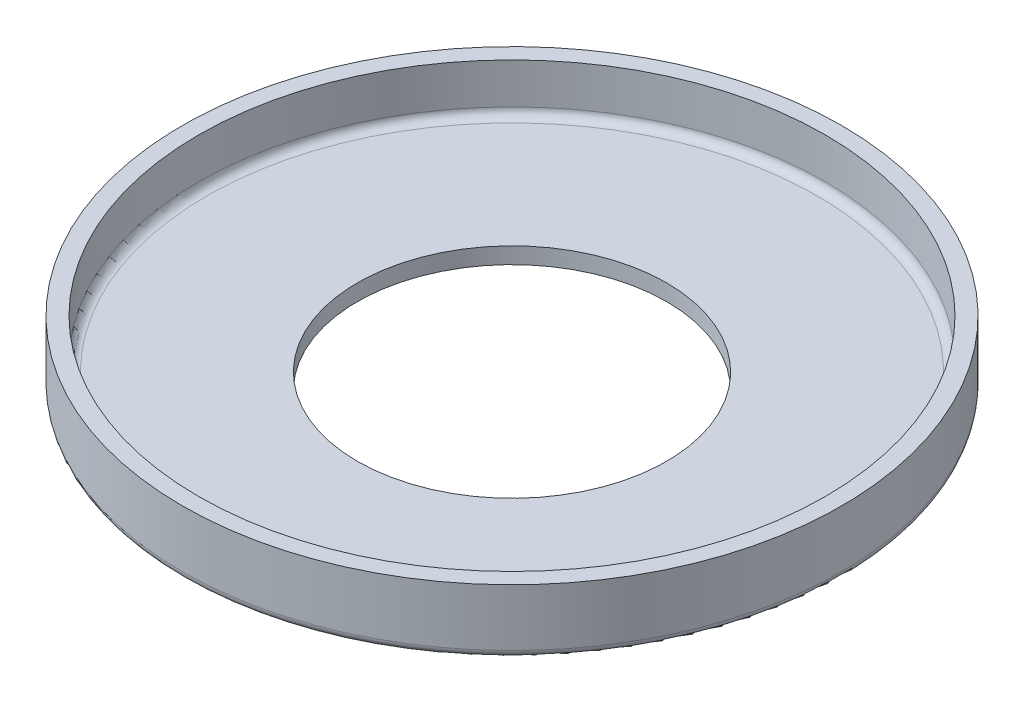
ISO-10303-21;
HEADER;
FILE_DESCRIPTION(('STEP AP214'),'2;1');
FILE_NAME('part.step','',(''),(''),'','','');
FILE_SCHEMA(('AUTOMOTIVE_DESIGN { 1 0 10303 214 1 1 1 1 }'));
ENDSEC;
DATA;
#1=APPLICATION_CONTEXT('core data for automotive mechanical design processes');
#2=APPLICATION_PROTOCOL_DEFINITION('international standard','automotive_design',2000,#1);
#3=PRODUCT_CONTEXT('',#1,'mechanical');
#4=PRODUCT('Part','Part','',(#3));
#5=PRODUCT_RELATED_PRODUCT_CATEGORY('part','',(#4));
#6=PRODUCT_DEFINITION_FORMATION('','',#4);
#7=PRODUCT_DEFINITION_CONTEXT('part definition',#1,'design');
#8=PRODUCT_DEFINITION('design','',#6,#7);
#9=PRODUCT_DEFINITION_SHAPE('','',#8);
#10=(LENGTH_UNIT() NAMED_UNIT(*) SI_UNIT(.MILLI.,.METRE.));
#11=(NAMED_UNIT(*) PLANE_ANGLE_UNIT() SI_UNIT($,.RADIAN.));
#12=(NAMED_UNIT(*) SI_UNIT($,.STERADIAN.) SOLID_ANGLE_UNIT());
#13=UNCERTAINTY_MEASURE_WITH_UNIT(LENGTH_MEASURE(1.E-05),#10,'distance_accuracy_value','');
#14=(GEOMETRIC_REPRESENTATION_CONTEXT(3) GLOBAL_UNCERTAINTY_ASSIGNED_CONTEXT((#13)) GLOBAL_UNIT_ASSIGNED_CONTEXT((#10,
#11,#12)) REPRESENTATION_CONTEXT('',''));
#15=CARTESIAN_POINT('',(0.,0.,0.));
#16=DIRECTION('',(0.,0.,1.));
#17=DIRECTION('',(1.,0.,0.));
#18=AXIS2_PLACEMENT_3D('',#15,#16,#17);
#19=CARTESIAN_POINT('',(0.,2.,0.));
#20=DIRECTION('',(0.,-1.,0.));
#21=DIRECTION('',(0.,0.,-1.));
#22=AXIS2_PLACEMENT_3D('',#19,#20,#21);
#23=CYLINDRICAL_SURFACE('',#22,19.);
#24=CARTESIAN_POINT('',(0.,2.,0.));
#25=DIRECTION('',(0.,1.,0.));
#26=DIRECTION('',(0.,0.,1.));
#27=AXIS2_PLACEMENT_3D('',#24,#25,#26);
#28=CIRCLE('',#27,19.);
#29=CARTESIAN_POINT('',(0.,2.,19.));
#30=VERTEX_POINT('',#29);
#31=EDGE_CURVE('E63',#30,#30,#28,.T.);
#32=ORIENTED_EDGE('',*,*,#31,.T.);
#33=EDGE_LOOP('',(#32));
#34=FACE_BOUND('',#33,.T.);
#35=CARTESIAN_POINT('',(0.,0.,0.));
#36=DIRECTION('',(0.,1.,0.));
#37=DIRECTION('',(0.,0.,1.));
#38=AXIS2_PLACEMENT_3D('',#35,#36,#37);
#39=CIRCLE('',#38,19.);
#40=CARTESIAN_POINT('',(0.,0.,19.));
#41=VERTEX_POINT('',#40);
#42=EDGE_CURVE('E64',#41,#41,#39,.T.);
#43=ORIENTED_EDGE('',*,*,#42,.F.);
#44=EDGE_LOOP('',(#43));
#45=FACE_BOUND('',#44,.T.);
#46=ADVANCED_FACE('F39',(#34,#45),#23,.F.);
#47=CARTESIAN_POINT('',(0.,2.,0.));
#48=DIRECTION('',(0.,-1.,0.));
#49=DIRECTION('',(0.,0.,-1.));
#50=AXIS2_PLACEMENT_3D('',#47,#48,#49);
#51=CYLINDRICAL_SURFACE('',#50,40.5);
#52=CARTESIAN_POINT('',(0.,1.,0.));
#53=DIRECTION('',(0.,1.,0.));
#54=DIRECTION('',(0.,0.,1.));
#55=AXIS2_PLACEMENT_3D('',#52,#53,#54);
#56=CIRCLE('',#55,40.5);
#57=CARTESIAN_POINT('',(0.,1.,40.5));
#58=VERTEX_POINT('',#57);
#59=EDGE_CURVE('E57',#58,#58,#56,.T.);
#60=ORIENTED_EDGE('',*,*,#59,.T.);
#61=EDGE_LOOP('',(#60));
#62=FACE_BOUND('',#61,.T.);
#63=CARTESIAN_POINT('',(0.,8.,0.));
#64=DIRECTION('',(0.,1.,0.));
#65=DIRECTION('',(0.,0.,1.));
#66=AXIS2_PLACEMENT_3D('',#63,#64,#65);
#67=CIRCLE('',#66,40.5);
#68=CARTESIAN_POINT('',(0.,8.,40.5));
#69=VERTEX_POINT('',#68);
#70=EDGE_CURVE('E68',#69,#69,#67,.T.);
#71=ORIENTED_EDGE('',*,*,#70,.F.);
#72=EDGE_LOOP('',(#71));
#73=FACE_BOUND('',#72,.T.);
#74=ADVANCED_FACE('F89',(#62,#73),#51,.T.);
#75=CARTESIAN_POINT('',(0.,2.,0.));
#76=DIRECTION('',(0.,1.,0.));
#77=DIRECTION('',(0.,0.,1.));
#78=AXIS2_PLACEMENT_3D('',#75,#76,#77);
#79=PLANE('',#78);
#80=CARTESIAN_POINT('',(0.,2.,0.));
#81=DIRECTION('',(0.,1.,0.));
#82=DIRECTION('',(0.,0.,1.));
#83=AXIS2_PLACEMENT_3D('',#80,#81,#82);
#84=CIRCLE('',#83,37.5);
#85=CARTESIAN_POINT('',(0.,2.,37.5));
#86=VERTEX_POINT('',#85);
#87=EDGE_CURVE('E10',#86,#86,#84,.T.);
#88=ORIENTED_EDGE('',*,*,#87,.T.);
#89=EDGE_LOOP('',(#88));
#90=FACE_BOUND('',#89,.T.);
#91=ORIENTED_EDGE('',*,*,#31,.F.);
#92=EDGE_LOOP('',(#91));
#93=FACE_BOUND('',#92,.T.);
#94=ADVANCED_FACE('F91',(#90,#93),#79,.T.);
#95=CARTESIAN_POINT('',(0.,0.,0.));
#96=DIRECTION('',(0.,1.,0.));
#97=DIRECTION('',(0.,0.,1.));
#98=AXIS2_PLACEMENT_3D('',#95,#96,#97);
#99=PLANE('',#98);
#100=CARTESIAN_POINT('',(0.,0.,0.));
#101=DIRECTION('',(0.,1.,0.));
#102=DIRECTION('',(0.,0.,1.));
#103=AXIS2_PLACEMENT_3D('',#100,#101,#102);
#104=CIRCLE('',#103,39.5);
#105=CARTESIAN_POINT('',(0.,0.,39.5));
#106=VERTEX_POINT('',#105);
#107=EDGE_CURVE('E52',#106,#106,#104,.F.);
#108=ORIENTED_EDGE('',*,*,#107,.T.);
#109=EDGE_LOOP('',(#108));
#110=FACE_BOUND('',#109,.T.);
#111=ORIENTED_EDGE('',*,*,#42,.T.);
#112=EDGE_LOOP('',(#111));
#113=FACE_BOUND('',#112,.T.);
#114=ADVANCED_FACE('F98',(#110,#113),#99,.F.);
#115=CARTESIAN_POINT('',(0.,8.,0.));
#116=DIRECTION('',(0.,-1.,0.));
#117=DIRECTION('',(0.,0.,-1.));
#118=AXIS2_PLACEMENT_3D('',#115,#116,#117);
#119=CYLINDRICAL_SURFACE('',#118,38.5);
#120=CARTESIAN_POINT('',(0.,3.,0.));
#121=DIRECTION('',(0.,1.,0.));
#122=DIRECTION('',(0.,0.,1.));
#123=AXIS2_PLACEMENT_3D('',#120,#121,#122);
#124=CIRCLE('',#123,38.5);
#125=CARTESIAN_POINT('',(0.,3.,38.5));
#126=VERTEX_POINT('',#125);
#127=EDGE_CURVE('E47',#126,#126,#124,.F.);
#128=ORIENTED_EDGE('',*,*,#127,.T.);
#129=EDGE_LOOP('',(#128));
#130=FACE_BOUND('',#129,.T.);
#131=CARTESIAN_POINT('',(0.,8.,0.));
#132=DIRECTION('',(0.,1.,0.));
#133=DIRECTION('',(0.,0.,1.));
#134=AXIS2_PLACEMENT_3D('',#131,#132,#133);
#135=CIRCLE('',#134,38.5);
#136=CARTESIAN_POINT('',(0.,8.,38.5));
#137=VERTEX_POINT('',#136);
#138=EDGE_CURVE('E75',#137,#137,#135,.T.);
#139=ORIENTED_EDGE('',*,*,#138,.T.);
#140=EDGE_LOOP('',(#139));
#141=FACE_BOUND('',#140,.T.);
#142=ADVANCED_FACE('F80',(#130,#141),#119,.F.);
#143=CARTESIAN_POINT('',(0.,8.,0.));
#144=DIRECTION('',(0.,1.,0.));
#145=DIRECTION('',(0.,0.,1.));
#146=AXIS2_PLACEMENT_3D('',#143,#144,#145);
#147=PLANE('',#146);
#148=ORIENTED_EDGE('',*,*,#138,.F.);
#149=EDGE_LOOP('',(#148));
#150=FACE_BOUND('',#149,.T.);
#151=ORIENTED_EDGE('',*,*,#70,.T.);
#152=EDGE_LOOP('',(#151));
#153=FACE_BOUND('',#152,.T.);
#154=ADVANCED_FACE('F82',(#150,#153),#147,.T.);
#155=CARTESIAN_POINT('',(0.,1.,0.));
#156=DIRECTION('',(0.,1.,0.));
#157=DIRECTION('',(0.,0.,1.));
#158=AXIS2_PLACEMENT_3D('',#155,#156,#157);
#159=TOROIDAL_SURFACE('',#158,39.5,1.);
#160=ORIENTED_EDGE('',*,*,#107,.F.);
#161=EDGE_LOOP('',(#160));
#162=FACE_BOUND('',#161,.T.);
#163=ORIENTED_EDGE('',*,*,#59,.F.);
#164=EDGE_LOOP('',(#163));
#165=FACE_BOUND('',#164,.T.);
#166=ADVANCED_FACE('F85',(#162,#165),#159,.T.);
#167=CARTESIAN_POINT('',(0.,3.,0.));
#168=DIRECTION('',(0.,1.,0.));
#169=DIRECTION('',(0.,0.,1.));
#170=AXIS2_PLACEMENT_3D('',#167,#168,#169);
#171=TOROIDAL_SURFACE('',#170,37.5,1.);
#172=ORIENTED_EDGE('',*,*,#87,.F.);
#173=EDGE_LOOP('',(#172));
#174=FACE_BOUND('',#173,.T.);
#175=ORIENTED_EDGE('',*,*,#127,.F.);
#176=EDGE_LOOP('',(#175));
#177=FACE_BOUND('',#176,.T.);
#178=ADVANCED_FACE('F41',(#174,#177),#171,.F.);
#179=CLOSED_SHELL('',(#46,#74,#94,#114,#142,#154,#166,#178));
#180=MANIFOLD_SOLID_BREP('B2',#179);
#181=ADVANCED_BREP_SHAPE_REPRESENTATION('',(#18,#180),#14);
#182=SHAPE_DEFINITION_REPRESENTATION(#9,#181);
ENDSEC;
END-ISO-10303-21;
